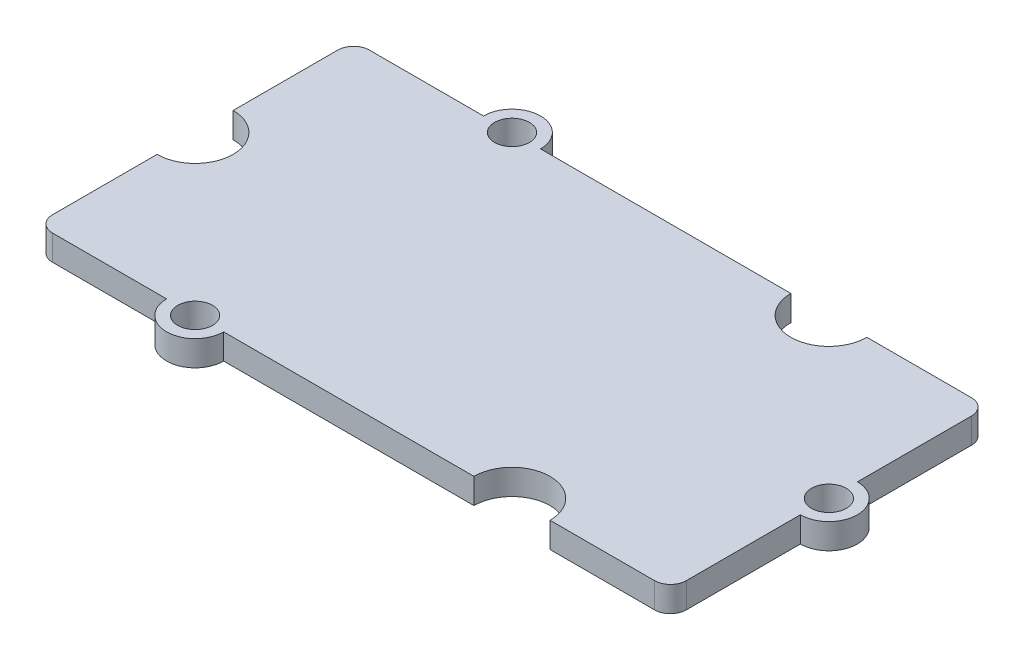
ISO-10303-21;
HEADER;
FILE_DESCRIPTION(('STEP AP214'),'2;1');
FILE_NAME('part.step','',(''),(''),'','','');
FILE_SCHEMA(('AUTOMOTIVE_DESIGN { 1 0 10303 214 1 1 1 1 }'));
ENDSEC;
DATA;
#1=APPLICATION_CONTEXT('core data for automotive mechanical design processes');
#2=APPLICATION_PROTOCOL_DEFINITION('international standard','automotive_design',2000,#1);
#3=PRODUCT_CONTEXT('',#1,'mechanical');
#4=PRODUCT('Part','Part','',(#3));
#5=PRODUCT_RELATED_PRODUCT_CATEGORY('part','',(#4));
#6=PRODUCT_DEFINITION_FORMATION('','',#4);
#7=PRODUCT_DEFINITION_CONTEXT('part definition',#1,'design');
#8=PRODUCT_DEFINITION('design','',#6,#7);
#9=PRODUCT_DEFINITION_SHAPE('','',#8);
#10=(LENGTH_UNIT() NAMED_UNIT(*) SI_UNIT(.MILLI.,.METRE.));
#11=(NAMED_UNIT(*) PLANE_ANGLE_UNIT() SI_UNIT($,.RADIAN.));
#12=(NAMED_UNIT(*) SI_UNIT($,.STERADIAN.) SOLID_ANGLE_UNIT());
#13=UNCERTAINTY_MEASURE_WITH_UNIT(LENGTH_MEASURE(1.E-05),#10,'distance_accuracy_value','');
#14=(GEOMETRIC_REPRESENTATION_CONTEXT(3) GLOBAL_UNCERTAINTY_ASSIGNED_CONTEXT((#13)) GLOBAL_UNIT_ASSIGNED_CONTEXT((#10,
#11,#12)) REPRESENTATION_CONTEXT('',''));
#15=CARTESIAN_POINT('',(0.,0.,0.));
#16=DIRECTION('',(0.,0.,1.));
#17=DIRECTION('',(1.,0.,0.));
#18=AXIS2_PLACEMENT_3D('',#15,#16,#17);
#19=CARTESIAN_POINT('',(20.,1.6,0.));
#20=DIRECTION('',(0.,-1.,0.));
#21=DIRECTION('',(0.,0.,-1.));
#22=AXIS2_PLACEMENT_3D('',#19,#20,#21);
#23=CYLINDRICAL_SURFACE('',#22,1.8);
#24=CARTESIAN_POINT('',(20.,0.,0.));
#25=DIRECTION('',(0.,1.,0.));
#26=DIRECTION('',(0.,0.,1.));
#27=AXIS2_PLACEMENT_3D('',#24,#25,#26);
#28=CIRCLE('',#27,1.8);
#29=CARTESIAN_POINT('',(20.,0.,1.8));
#30=VERTEX_POINT('',#29);
#31=CARTESIAN_POINT('',(20.,0.,-1.8));
#32=VERTEX_POINT('',#31);
#33=EDGE_CURVE('E214',#30,#32,#28,.T.);
#34=ORIENTED_EDGE('',*,*,#33,.T.);
#35=DIRECTION('',(0.,-1.,0.));
#36=VECTOR('',#35,1.);
#37=CARTESIAN_POINT('',(20.,1.6,-1.8));
#38=LINE('',#37,#36);
#39=CARTESIAN_POINT('',(20.,1.6,-1.8));
#40=VERTEX_POINT('',#39);
#41=EDGE_CURVE('E11',#40,#32,#38,.T.);
#42=ORIENTED_EDGE('',*,*,#41,.F.);
#43=CARTESIAN_POINT('',(20.,1.6,0.));
#44=DIRECTION('',(0.,1.,0.));
#45=DIRECTION('',(0.,0.,1.));
#46=AXIS2_PLACEMENT_3D('',#43,#44,#45);
#47=CIRCLE('',#46,1.8);
#48=CARTESIAN_POINT('',(20.,1.6,1.8));
#49=VERTEX_POINT('',#48);
#50=EDGE_CURVE('E265',#49,#40,#47,.T.);
#51=ORIENTED_EDGE('',*,*,#50,.F.);
#52=DIRECTION('',(0.,-1.,0.));
#53=VECTOR('',#52,1.);
#54=CARTESIAN_POINT('',(20.,1.6,1.8));
#55=LINE('',#54,#53);
#56=EDGE_CURVE('E213',#49,#30,#55,.T.);
#57=ORIENTED_EDGE('',*,*,#56,.T.);
#58=EDGE_LOOP('',(#34,#42,#51,#57));
#59=FACE_BOUND('',#58,.T.);
#60=ADVANCED_FACE('F34',(#59),#23,.T.);
#61=CARTESIAN_POINT('',(20.,1.6,0.));
#62=DIRECTION('',(-1.,0.,0.));
#63=DIRECTION('',(0.,0.,1.));
#64=AXIS2_PLACEMENT_3D('',#61,#62,#63);
#65=PLANE('',#64);
#66=DIRECTION('',(0.,0.,-1.));
#67=VECTOR('',#66,1.);
#68=CARTESIAN_POINT('',(20.,0.,0.));
#69=LINE('',#68,#67);
#70=CARTESIAN_POINT('',(20.,0.,-9.));
#71=VERTEX_POINT('',#70);
#72=EDGE_CURVE('E217',#32,#71,#69,.T.);
#73=ORIENTED_EDGE('',*,*,#72,.T.);
#74=DIRECTION('',(0.,-1.,0.));
#75=VECTOR('',#74,1.);
#76=CARTESIAN_POINT('',(20.,1.6,-9.));
#77=LINE('',#76,#75);
#78=CARTESIAN_POINT('',(20.,1.6,-9.));
#79=VERTEX_POINT('',#78);
#80=EDGE_CURVE('E42',#79,#71,#77,.T.);
#81=ORIENTED_EDGE('',*,*,#80,.F.);
#82=DIRECTION('',(0.,0.,-1.));
#83=VECTOR('',#82,1.);
#84=CARTESIAN_POINT('',(20.,1.6,0.));
#85=LINE('',#84,#83);
#86=EDGE_CURVE('E129',#40,#79,#85,.T.);
#87=ORIENTED_EDGE('',*,*,#86,.F.);
#88=ORIENTED_EDGE('',*,*,#41,.T.);
#89=EDGE_LOOP('',(#73,#81,#87,#88));
#90=FACE_BOUND('',#89,.T.);
#91=ADVANCED_FACE('F304',(#90),#65,.F.);
#92=CARTESIAN_POINT('',(19.,1.6,-9.));
#93=DIRECTION('',(0.,-1.,0.));
#94=DIRECTION('',(0.,0.,-1.));
#95=AXIS2_PLACEMENT_3D('',#92,#93,#94);
#96=CYLINDRICAL_SURFACE('',#95,1.);
#97=CARTESIAN_POINT('',(19.,0.,-9.));
#98=DIRECTION('',(0.,1.,0.));
#99=DIRECTION('',(0.,0.,1.));
#100=AXIS2_PLACEMENT_3D('',#97,#98,#99);
#101=CIRCLE('',#100,1.);
#102=CARTESIAN_POINT('',(19.,0.,-10.));
#103=VERTEX_POINT('',#102);
#104=EDGE_CURVE('E220',#103,#71,#101,.F.);
#105=ORIENTED_EDGE('',*,*,#104,.F.);
#106=DIRECTION('',(0.,-1.,0.));
#107=VECTOR('',#106,1.);
#108=CARTESIAN_POINT('',(19.,1.6,-10.));
#109=LINE('',#108,#107);
#110=CARTESIAN_POINT('',(19.,1.6,-10.));
#111=VERTEX_POINT('',#110);
#112=EDGE_CURVE('E297',#111,#103,#109,.T.);
#113=ORIENTED_EDGE('',*,*,#112,.F.);
#114=CARTESIAN_POINT('',(19.,1.6,-9.));
#115=DIRECTION('',(0.,1.,0.));
#116=DIRECTION('',(0.,0.,1.));
#117=AXIS2_PLACEMENT_3D('',#114,#115,#116);
#118=CIRCLE('',#117,1.);
#119=EDGE_CURVE('E303',#111,#79,#118,.F.);
#120=ORIENTED_EDGE('',*,*,#119,.T.);
#121=ORIENTED_EDGE('',*,*,#80,.T.);
#122=EDGE_LOOP('',(#105,#113,#120,#121));
#123=FACE_BOUND('',#122,.T.);
#124=ADVANCED_FACE('F301',(#123),#96,.T.);
#125=CARTESIAN_POINT('',(0.,1.6,-9.99999999999999));
#126=DIRECTION('',(0.,0.,-1.));
#127=DIRECTION('',(-1.,0.,0.));
#128=AXIS2_PLACEMENT_3D('',#125,#126,#127);
#129=PLANE('',#128);
#130=DIRECTION('',(1.,0.,0.));
#131=VECTOR('',#130,1.);
#132=CARTESIAN_POINT('',(0.,0.,-9.99999999999999));
#133=LINE('',#132,#131);
#134=CARTESIAN_POINT('',(12.4,0.,-10.));
#135=VERTEX_POINT('',#134);
#136=EDGE_CURVE('E223',#135,#103,#133,.T.);
#137=ORIENTED_EDGE('',*,*,#136,.F.);
#138=DIRECTION('',(0.,-1.,0.));
#139=VECTOR('',#138,1.);
#140=CARTESIAN_POINT('',(12.4,1.6,-10.));
#141=LINE('',#140,#139);
#142=CARTESIAN_POINT('',(12.4,1.6,-10.));
#143=VERTEX_POINT('',#142);
#144=EDGE_CURVE('E295',#143,#135,#141,.T.);
#145=ORIENTED_EDGE('',*,*,#144,.F.);
#146=DIRECTION('',(1.,0.,0.));
#147=VECTOR('',#146,1.);
#148=CARTESIAN_POINT('',(0.,1.6,-9.99999999999999));
#149=LINE('',#148,#147);
#150=EDGE_CURVE('E317',#143,#111,#149,.T.);
#151=ORIENTED_EDGE('',*,*,#150,.T.);
#152=ORIENTED_EDGE('',*,*,#112,.T.);
#153=EDGE_LOOP('',(#137,#145,#151,#152));
#154=FACE_BOUND('',#153,.T.);
#155=ADVANCED_FACE('F314',(#154),#129,.T.);
#156=CARTESIAN_POINT('',(10.,1.6,-9.99999999999999));
#157=DIRECTION('',(0.,-1.,0.));
#158=DIRECTION('',(0.,0.,-1.));
#159=AXIS2_PLACEMENT_3D('',#156,#157,#158);
#160=CYLINDRICAL_SURFACE('',#159,2.4);
#161=CARTESIAN_POINT('',(10.,0.,-9.99999999999999));
#162=DIRECTION('',(0.,1.,0.));
#163=DIRECTION('',(0.,0.,1.));
#164=AXIS2_PLACEMENT_3D('',#161,#162,#163);
#165=CIRCLE('',#164,2.4);
#166=CARTESIAN_POINT('',(7.6,0.,-10.));
#167=VERTEX_POINT('',#166);
#168=EDGE_CURVE('E226',#167,#135,#165,.T.);
#169=ORIENTED_EDGE('',*,*,#168,.F.);
#170=DIRECTION('',(0.,-1.,0.));
#171=VECTOR('',#170,1.);
#172=CARTESIAN_POINT('',(7.6,1.6,-10.));
#173=LINE('',#172,#171);
#174=CARTESIAN_POINT('',(7.6,1.6,-10.));
#175=VERTEX_POINT('',#174);
#176=EDGE_CURVE('E293',#175,#167,#173,.T.);
#177=ORIENTED_EDGE('',*,*,#176,.F.);
#178=CARTESIAN_POINT('',(10.,1.6,-9.99999999999999));
#179=DIRECTION('',(0.,1.,0.));
#180=DIRECTION('',(0.,0.,1.));
#181=AXIS2_PLACEMENT_3D('',#178,#179,#180);
#182=CIRCLE('',#181,2.4);
#183=EDGE_CURVE('E321',#175,#143,#182,.T.);
#184=ORIENTED_EDGE('',*,*,#183,.T.);
#185=ORIENTED_EDGE('',*,*,#144,.T.);
#186=EDGE_LOOP('',(#169,#177,#184,#185));
#187=FACE_BOUND('',#186,.T.);
#188=ADVANCED_FACE('F399',(#187),#160,.F.);
#189=CARTESIAN_POINT('',(-8.2,0.,-9.99999999999999));
#190=VERTEX_POINT('',#189);
#191=EDGE_CURVE('E228',#190,#167,#133,.T.);
#192=ORIENTED_EDGE('',*,*,#191,.F.);
#193=DIRECTION('',(0.,-1.,0.));
#194=VECTOR('',#193,1.);
#195=CARTESIAN_POINT('',(-8.2,1.6,-9.99999999999999));
#196=LINE('',#195,#194);
#197=CARTESIAN_POINT('',(-8.2,1.6,-9.99999999999999));
#198=VERTEX_POINT('',#197);
#199=EDGE_CURVE('E291',#198,#190,#196,.T.);
#200=ORIENTED_EDGE('',*,*,#199,.F.);
#201=EDGE_CURVE('E324',#198,#175,#149,.T.);
#202=ORIENTED_EDGE('',*,*,#201,.T.);
#203=ORIENTED_EDGE('',*,*,#176,.T.);
#204=EDGE_LOOP('',(#192,#200,#202,#203));
#205=FACE_BOUND('',#204,.T.);
#206=ADVANCED_FACE('F394',(#205),#129,.T.);
#207=CARTESIAN_POINT('',(-10.,1.6,-9.99999999999999));
#208=DIRECTION('',(0.,-1.,0.));
#209=DIRECTION('',(0.,0.,-1.));
#210=AXIS2_PLACEMENT_3D('',#207,#208,#209);
#211=CYLINDRICAL_SURFACE('',#210,1.8);
#212=CARTESIAN_POINT('',(-10.,0.,-9.99999999999999));
#213=DIRECTION('',(0.,1.,0.));
#214=DIRECTION('',(0.,0.,1.));
#215=AXIS2_PLACEMENT_3D('',#212,#213,#214);
#216=CIRCLE('',#215,1.8);
#217=CARTESIAN_POINT('',(-11.8,0.,-9.99999999999999));
#218=VERTEX_POINT('',#217);
#219=EDGE_CURVE('E231',#190,#218,#216,.T.);
#220=ORIENTED_EDGE('',*,*,#219,.T.);
#221=DIRECTION('',(0.,-1.,0.));
#222=VECTOR('',#221,1.);
#223=CARTESIAN_POINT('',(-11.8,1.6,-9.99999999999999));
#224=LINE('',#223,#222);
#225=CARTESIAN_POINT('',(-11.8,1.6,-9.99999999999999));
#226=VERTEX_POINT('',#225);
#227=EDGE_CURVE('E289',#226,#218,#224,.T.);
#228=ORIENTED_EDGE('',*,*,#227,.F.);
#229=CARTESIAN_POINT('',(-10.,1.6,-9.99999999999999));
#230=DIRECTION('',(0.,1.,0.));
#231=DIRECTION('',(0.,0.,1.));
#232=AXIS2_PLACEMENT_3D('',#229,#230,#231);
#233=CIRCLE('',#232,1.8);
#234=EDGE_CURVE('E328',#198,#226,#233,.T.);
#235=ORIENTED_EDGE('',*,*,#234,.F.);
#236=ORIENTED_EDGE('',*,*,#199,.T.);
#237=EDGE_LOOP('',(#220,#228,#235,#236));
#238=FACE_BOUND('',#237,.T.);
#239=ADVANCED_FACE('F401',(#238),#211,.T.);
#240=CARTESIAN_POINT('',(-19.,0.,-9.99999999999999));
#241=VERTEX_POINT('',#240);
#242=EDGE_CURVE('E227',#241,#218,#133,.T.);
#243=ORIENTED_EDGE('',*,*,#242,.F.);
#244=DIRECTION('',(0.,-1.,0.));
#245=VECTOR('',#244,1.);
#246=CARTESIAN_POINT('',(-19.,1.6,-9.99999999999999));
#247=LINE('',#246,#245);
#248=CARTESIAN_POINT('',(-19.,1.6,-9.99999999999999));
#249=VERTEX_POINT('',#248);
#250=EDGE_CURVE('E287',#249,#241,#247,.T.);
#251=ORIENTED_EDGE('',*,*,#250,.F.);
#252=EDGE_CURVE('E323',#249,#226,#149,.T.);
#253=ORIENTED_EDGE('',*,*,#252,.T.);
#254=ORIENTED_EDGE('',*,*,#227,.T.);
#255=EDGE_LOOP('',(#243,#251,#253,#254));
#256=FACE_BOUND('',#255,.T.);
#257=ADVANCED_FACE('F390',(#256),#129,.T.);
#258=CARTESIAN_POINT('',(-19.,1.6,-8.99999999999999));
#259=DIRECTION('',(0.,-1.,0.));
#260=DIRECTION('',(0.,0.,-1.));
#261=AXIS2_PLACEMENT_3D('',#258,#259,#260);
#262=CYLINDRICAL_SURFACE('',#261,1.);
#263=CARTESIAN_POINT('',(-19.,0.,-8.99999999999999));
#264=DIRECTION('',(0.,1.,0.));
#265=DIRECTION('',(0.,0.,1.));
#266=AXIS2_PLACEMENT_3D('',#263,#264,#265);
#267=CIRCLE('',#266,1.);
#268=CARTESIAN_POINT('',(-20.,0.,-8.99999999999999));
#269=VERTEX_POINT('',#268);
#270=EDGE_CURVE('E234',#269,#241,#267,.F.);
#271=ORIENTED_EDGE('',*,*,#270,.F.);
#272=DIRECTION('',(0.,-1.,0.));
#273=VECTOR('',#272,1.);
#274=CARTESIAN_POINT('',(-20.,1.6,-8.99999999999999));
#275=LINE('',#274,#273);
#276=CARTESIAN_POINT('',(-20.,1.6,-8.99999999999999));
#277=VERTEX_POINT('',#276);
#278=EDGE_CURVE('E285',#277,#269,#275,.T.);
#279=ORIENTED_EDGE('',*,*,#278,.F.);
#280=CARTESIAN_POINT('',(-19.,1.6,-8.99999999999999));
#281=DIRECTION('',(0.,1.,0.));
#282=DIRECTION('',(0.,0.,1.));
#283=AXIS2_PLACEMENT_3D('',#280,#281,#282);
#284=CIRCLE('',#283,1.);
#285=EDGE_CURVE('E330',#277,#249,#284,.F.);
#286=ORIENTED_EDGE('',*,*,#285,.T.);
#287=ORIENTED_EDGE('',*,*,#250,.T.);
#288=EDGE_LOOP('',(#271,#279,#286,#287));
#289=FACE_BOUND('',#288,.T.);
#290=ADVANCED_FACE('F385',(#289),#262,.T.);
#291=CARTESIAN_POINT('',(-20.,1.6,0.));
#292=DIRECTION('',(-1.,0.,0.));
#293=DIRECTION('',(0.,0.,1.));
#294=AXIS2_PLACEMENT_3D('',#291,#292,#293);
#295=PLANE('',#294);
#296=DIRECTION('',(0.,0.,-1.));
#297=VECTOR('',#296,1.);
#298=CARTESIAN_POINT('',(-20.,0.,0.));
#299=LINE('',#298,#297);
#300=CARTESIAN_POINT('',(-20.,0.,-2.39999999999999));
#301=VERTEX_POINT('',#300);
#302=EDGE_CURVE('E237',#301,#269,#299,.T.);
#303=ORIENTED_EDGE('',*,*,#302,.F.);
#304=DIRECTION('',(0.,-1.,0.));
#305=VECTOR('',#304,1.);
#306=CARTESIAN_POINT('',(-20.,1.6,-2.39999999999999));
#307=LINE('',#306,#305);
#308=CARTESIAN_POINT('',(-20.,1.6,-2.39999999999999));
#309=VERTEX_POINT('',#308);
#310=EDGE_CURVE('E283',#309,#301,#307,.T.);
#311=ORIENTED_EDGE('',*,*,#310,.F.);
#312=DIRECTION('',(0.,0.,-1.));
#313=VECTOR('',#312,1.);
#314=CARTESIAN_POINT('',(-20.,1.6,0.));
#315=LINE('',#314,#313);
#316=EDGE_CURVE('E333',#309,#277,#315,.T.);
#317=ORIENTED_EDGE('',*,*,#316,.T.);
#318=ORIENTED_EDGE('',*,*,#278,.T.);
#319=EDGE_LOOP('',(#303,#311,#317,#318));
#320=FACE_BOUND('',#319,.T.);
#321=ADVANCED_FACE('F379',(#320),#295,.T.);
#322=CARTESIAN_POINT('',(-20.,1.6,0.));
#323=DIRECTION('',(0.,-1.,0.));
#324=DIRECTION('',(0.,0.,-1.));
#325=AXIS2_PLACEMENT_3D('',#322,#323,#324);
#326=CYLINDRICAL_SURFACE('',#325,2.4);
#327=CARTESIAN_POINT('',(-20.,0.,0.));
#328=DIRECTION('',(0.,1.,0.));
#329=DIRECTION('',(0.,0.,1.));
#330=AXIS2_PLACEMENT_3D('',#327,#328,#329);
#331=CIRCLE('',#330,2.4);
#332=CARTESIAN_POINT('',(-20.,0.,2.40000000000001));
#333=VERTEX_POINT('',#332);
#334=EDGE_CURVE('E240',#333,#301,#331,.T.);
#335=ORIENTED_EDGE('',*,*,#334,.F.);
#336=DIRECTION('',(0.,-1.,0.));
#337=VECTOR('',#336,1.);
#338=CARTESIAN_POINT('',(-20.,1.6,2.40000000000001));
#339=LINE('',#338,#337);
#340=CARTESIAN_POINT('',(-20.,1.6,2.40000000000001));
#341=VERTEX_POINT('',#340);
#342=EDGE_CURVE('E281',#341,#333,#339,.T.);
#343=ORIENTED_EDGE('',*,*,#342,.F.);
#344=CARTESIAN_POINT('',(-20.,1.6,0.));
#345=DIRECTION('',(0.,1.,0.));
#346=DIRECTION('',(0.,0.,1.));
#347=AXIS2_PLACEMENT_3D('',#344,#345,#346);
#348=CIRCLE('',#347,2.4);
#349=EDGE_CURVE('E336',#341,#309,#348,.T.);
#350=ORIENTED_EDGE('',*,*,#349,.T.);
#351=ORIENTED_EDGE('',*,*,#310,.T.);
#352=EDGE_LOOP('',(#335,#343,#350,#351));
#353=FACE_BOUND('',#352,.T.);
#354=ADVANCED_FACE('F375',(#353),#326,.F.);
#355=CARTESIAN_POINT('',(-20.,0.,9.00000000000001));
#356=VERTEX_POINT('',#355);
#357=EDGE_CURVE('E241',#356,#333,#299,.T.);
#358=ORIENTED_EDGE('',*,*,#357,.F.);
#359=DIRECTION('',(0.,-1.,0.));
#360=VECTOR('',#359,1.);
#361=CARTESIAN_POINT('',(-20.,1.6,9.00000000000001));
#362=LINE('',#361,#360);
#363=CARTESIAN_POINT('',(-20.,1.6,9.00000000000001));
#364=VERTEX_POINT('',#363);
#365=EDGE_CURVE('E279',#364,#356,#362,.T.);
#366=ORIENTED_EDGE('',*,*,#365,.F.);
#367=EDGE_CURVE('E337',#364,#341,#315,.T.);
#368=ORIENTED_EDGE('',*,*,#367,.T.);
#369=ORIENTED_EDGE('',*,*,#342,.T.);
#370=EDGE_LOOP('',(#358,#366,#368,#369));
#371=FACE_BOUND('',#370,.T.);
#372=ADVANCED_FACE('F370',(#371),#295,.T.);
#373=CARTESIAN_POINT('',(-19.,1.6,9.00000000000001));
#374=DIRECTION('',(0.,-1.,0.));
#375=DIRECTION('',(0.,0.,-1.));
#376=AXIS2_PLACEMENT_3D('',#373,#374,#375);
#377=CYLINDRICAL_SURFACE('',#376,1.);
#378=CARTESIAN_POINT('',(-19.,0.,9.00000000000001));
#379=DIRECTION('',(0.,1.,0.));
#380=DIRECTION('',(0.,0.,1.));
#381=AXIS2_PLACEMENT_3D('',#378,#379,#380);
#382=CIRCLE('',#381,1.);
#383=CARTESIAN_POINT('',(-19.,0.,10.));
#384=VERTEX_POINT('',#383);
#385=EDGE_CURVE('E244',#384,#356,#382,.F.);
#386=ORIENTED_EDGE('',*,*,#385,.F.);
#387=DIRECTION('',(0.,-1.,0.));
#388=VECTOR('',#387,1.);
#389=CARTESIAN_POINT('',(-19.,1.6,10.));
#390=LINE('',#389,#388);
#391=CARTESIAN_POINT('',(-19.,1.6,10.));
#392=VERTEX_POINT('',#391);
#393=EDGE_CURVE('E277',#392,#384,#390,.T.);
#394=ORIENTED_EDGE('',*,*,#393,.F.);
#395=CARTESIAN_POINT('',(-19.,1.6,9.00000000000001));
#396=DIRECTION('',(0.,1.,0.));
#397=DIRECTION('',(0.,0.,1.));
#398=AXIS2_PLACEMENT_3D('',#395,#396,#397);
#399=CIRCLE('',#398,1.);
#400=EDGE_CURVE('E340',#392,#364,#399,.F.);
#401=ORIENTED_EDGE('',*,*,#400,.T.);
#402=ORIENTED_EDGE('',*,*,#365,.T.);
#403=EDGE_LOOP('',(#386,#394,#401,#402));
#404=FACE_BOUND('',#403,.T.);
#405=ADVANCED_FACE('F365',(#404),#377,.T.);
#406=CARTESIAN_POINT('',(0.,1.6,10.));
#407=DIRECTION('',(0.,0.,-1.));
#408=DIRECTION('',(-1.,0.,0.));
#409=AXIS2_PLACEMENT_3D('',#406,#407,#408);
#410=PLANE('',#409);
#411=DIRECTION('',(1.,0.,0.));
#412=VECTOR('',#411,1.);
#413=CARTESIAN_POINT('',(0.,0.,10.));
#414=LINE('',#413,#412);
#415=CARTESIAN_POINT('',(-11.8,0.,10.));
#416=VERTEX_POINT('',#415);
#417=EDGE_CURVE('E247',#384,#416,#414,.T.);
#418=ORIENTED_EDGE('',*,*,#417,.T.);
#419=DIRECTION('',(0.,-1.,0.));
#420=VECTOR('',#419,1.);
#421=CARTESIAN_POINT('',(-11.8,1.6,10.));
#422=LINE('',#421,#420);
#423=CARTESIAN_POINT('',(-11.8,1.6,10.));
#424=VERTEX_POINT('',#423);
#425=EDGE_CURVE('E274',#424,#416,#422,.T.);
#426=ORIENTED_EDGE('',*,*,#425,.F.);
#427=DIRECTION('',(1.,0.,0.));
#428=VECTOR('',#427,1.);
#429=CARTESIAN_POINT('',(0.,1.6,10.));
#430=LINE('',#429,#428);
#431=EDGE_CURVE('E190',#392,#424,#430,.T.);
#432=ORIENTED_EDGE('',*,*,#431,.F.);
#433=ORIENTED_EDGE('',*,*,#393,.T.);
#434=EDGE_LOOP('',(#418,#426,#432,#433));
#435=FACE_BOUND('',#434,.T.);
#436=ADVANCED_FACE('F362',(#435),#410,.F.);
#437=CARTESIAN_POINT('',(-10.,1.6,10.));
#438=DIRECTION('',(0.,-1.,0.));
#439=DIRECTION('',(0.,0.,-1.));
#440=AXIS2_PLACEMENT_3D('',#437,#438,#439);
#441=CYLINDRICAL_SURFACE('',#440,1.8);
#442=CARTESIAN_POINT('',(-10.,0.,10.));
#443=DIRECTION('',(0.,1.,0.));
#444=DIRECTION('',(0.,0.,1.));
#445=AXIS2_PLACEMENT_3D('',#442,#443,#444);
#446=CIRCLE('',#445,1.8);
#447=CARTESIAN_POINT('',(-8.2,0.,10.));
#448=VERTEX_POINT('',#447);
#449=EDGE_CURVE('E249',#416,#448,#446,.T.);
#450=ORIENTED_EDGE('',*,*,#449,.T.);
#451=DIRECTION('',(0.,-1.,0.));
#452=VECTOR('',#451,1.);
#453=CARTESIAN_POINT('',(-8.2,1.6,10.));
#454=LINE('',#453,#452);
#455=CARTESIAN_POINT('',(-8.2,1.6,10.));
#456=VERTEX_POINT('',#455);
#457=EDGE_CURVE('E271',#456,#448,#454,.T.);
#458=ORIENTED_EDGE('',*,*,#457,.F.);
#459=CARTESIAN_POINT('',(-10.,1.6,10.));
#460=DIRECTION('',(0.,1.,0.));
#461=DIRECTION('',(0.,0.,1.));
#462=AXIS2_PLACEMENT_3D('',#459,#460,#461);
#463=CIRCLE('',#462,1.8);
#464=EDGE_CURVE('E342',#424,#456,#463,.T.);
#465=ORIENTED_EDGE('',*,*,#464,.F.);
#466=ORIENTED_EDGE('',*,*,#425,.T.);
#467=EDGE_LOOP('',(#450,#458,#465,#466));
#468=FACE_BOUND('',#467,.T.);
#469=ADVANCED_FACE('F358',(#468),#441,.T.);
#470=CARTESIAN_POINT('',(7.6,0.,10.));
#471=VERTEX_POINT('',#470);
#472=EDGE_CURVE('E250',#448,#471,#414,.T.);
#473=ORIENTED_EDGE('',*,*,#472,.T.);
#474=DIRECTION('',(0.,-1.,0.));
#475=VECTOR('',#474,1.);
#476=CARTESIAN_POINT('',(7.6,1.6,10.));
#477=LINE('',#476,#475);
#478=CARTESIAN_POINT('',(7.6,1.6,10.));
#479=VERTEX_POINT('',#478);
#480=EDGE_CURVE('E269',#479,#471,#477,.T.);
#481=ORIENTED_EDGE('',*,*,#480,.F.);
#482=EDGE_CURVE('E189',#456,#479,#430,.T.);
#483=ORIENTED_EDGE('',*,*,#482,.F.);
#484=ORIENTED_EDGE('',*,*,#457,.T.);
#485=EDGE_LOOP('',(#473,#481,#483,#484));
#486=FACE_BOUND('',#485,.T.);
#487=ADVANCED_FACE('F353',(#486),#410,.F.);
#488=CARTESIAN_POINT('',(10.,1.6,10.));
#489=DIRECTION('',(0.,-1.,0.));
#490=DIRECTION('',(0.,0.,-1.));
#491=AXIS2_PLACEMENT_3D('',#488,#489,#490);
#492=CYLINDRICAL_SURFACE('',#491,2.4);
#493=CARTESIAN_POINT('',(10.,0.,10.));
#494=DIRECTION('',(0.,1.,0.));
#495=DIRECTION('',(0.,0.,1.));
#496=AXIS2_PLACEMENT_3D('',#493,#494,#495);
#497=CIRCLE('',#496,2.4);
#498=CARTESIAN_POINT('',(12.4,0.,10.));
#499=VERTEX_POINT('',#498);
#500=EDGE_CURVE('E252',#499,#471,#497,.T.);
#501=ORIENTED_EDGE('',*,*,#500,.F.);
#502=DIRECTION('',(0.,-1.,0.));
#503=VECTOR('',#502,1.);
#504=CARTESIAN_POINT('',(12.4,1.6,10.));
#505=LINE('',#504,#503);
#506=CARTESIAN_POINT('',(12.4,1.6,10.));
#507=VERTEX_POINT('',#506);
#508=EDGE_CURVE('E195',#507,#499,#505,.T.);
#509=ORIENTED_EDGE('',*,*,#508,.F.);
#510=CARTESIAN_POINT('',(10.,1.6,10.));
#511=DIRECTION('',(0.,1.,0.));
#512=DIRECTION('',(0.,0.,1.));
#513=AXIS2_PLACEMENT_3D('',#510,#511,#512);
#514=CIRCLE('',#513,2.4);
#515=EDGE_CURVE('E186',#507,#479,#514,.T.);
#516=ORIENTED_EDGE('',*,*,#515,.T.);
#517=ORIENTED_EDGE('',*,*,#480,.T.);
#518=EDGE_LOOP('',(#501,#509,#516,#517));
#519=FACE_BOUND('',#518,.T.);
#520=ADVANCED_FACE('F349',(#519),#492,.F.);
#521=CARTESIAN_POINT('',(19.,0.,10.));
#522=VERTEX_POINT('',#521);
#523=EDGE_CURVE('E194',#499,#522,#414,.T.);
#524=ORIENTED_EDGE('',*,*,#523,.T.);
#525=DIRECTION('',(0.,-1.,0.));
#526=VECTOR('',#525,1.);
#527=CARTESIAN_POINT('',(19.,1.6,10.));
#528=LINE('',#527,#526);
#529=CARTESIAN_POINT('',(19.,1.6,10.));
#530=VERTEX_POINT('',#529);
#531=EDGE_CURVE('E191',#530,#522,#528,.T.);
#532=ORIENTED_EDGE('',*,*,#531,.F.);
#533=EDGE_CURVE('E179',#507,#530,#430,.T.);
#534=ORIENTED_EDGE('',*,*,#533,.F.);
#535=ORIENTED_EDGE('',*,*,#508,.T.);
#536=EDGE_LOOP('',(#524,#532,#534,#535));
#537=FACE_BOUND('',#536,.T.);
#538=ADVANCED_FACE('F192',(#537),#410,.F.);
#539=CARTESIAN_POINT('',(19.,1.6,9.00000000000001));
#540=DIRECTION('',(0.,-1.,0.));
#541=DIRECTION('',(0.,0.,-1.));
#542=AXIS2_PLACEMENT_3D('',#539,#540,#541);
#543=CYLINDRICAL_SURFACE('',#542,1.);
#544=CARTESIAN_POINT('',(19.,0.,9.00000000000001));
#545=DIRECTION('',(0.,1.,0.));
#546=DIRECTION('',(0.,0.,1.));
#547=AXIS2_PLACEMENT_3D('',#544,#545,#546);
#548=CIRCLE('',#547,1.);
#549=CARTESIAN_POINT('',(20.,0.,9.00000000000001));
#550=VERTEX_POINT('',#549);
#551=EDGE_CURVE('E115',#522,#550,#548,.T.);
#552=ORIENTED_EDGE('',*,*,#551,.T.);
#553=DIRECTION('',(0.,-1.,0.));
#554=VECTOR('',#553,1.);
#555=CARTESIAN_POINT('',(20.,1.6,9.00000000000001));
#556=LINE('',#555,#554);
#557=CARTESIAN_POINT('',(20.,1.6,9.00000000000001));
#558=VERTEX_POINT('',#557);
#559=EDGE_CURVE('E196',#558,#550,#556,.T.);
#560=ORIENTED_EDGE('',*,*,#559,.F.);
#561=CARTESIAN_POINT('',(19.,1.6,9.00000000000001));
#562=DIRECTION('',(0.,1.,0.));
#563=DIRECTION('',(0.,0.,1.));
#564=AXIS2_PLACEMENT_3D('',#561,#562,#563);
#565=CIRCLE('',#564,1.);
#566=EDGE_CURVE('E184',#530,#558,#565,.T.);
#567=ORIENTED_EDGE('',*,*,#566,.F.);
#568=ORIENTED_EDGE('',*,*,#531,.T.);
#569=EDGE_LOOP('',(#552,#560,#567,#568));
#570=FACE_BOUND('',#569,.T.);
#571=ADVANCED_FACE('F198',(#570),#543,.T.);
#572=CARTESIAN_POINT('',(20.,1.6,0.));
#573=DIRECTION('',(0.,-1.,0.));
#574=DIRECTION('',(0.,0.,-1.));
#575=AXIS2_PLACEMENT_3D('',#572,#573,#574);
#576=CYLINDRICAL_SURFACE('',#575,1.1);
#577=CARTESIAN_POINT('',(20.,1.6,0.));
#578=DIRECTION('',(0.,1.,0.));
#579=DIRECTION('',(0.,0.,1.));
#580=AXIS2_PLACEMENT_3D('',#577,#578,#579);
#581=CIRCLE('',#580,1.1);
#582=CARTESIAN_POINT('',(20.,1.6,1.1));
#583=VERTEX_POINT('',#582);
#584=EDGE_CURVE('E207',#583,#583,#581,.T.);
#585=ORIENTED_EDGE('',*,*,#584,.T.);
#586=EDGE_LOOP('',(#585));
#587=FACE_BOUND('',#586,.T.);
#588=CARTESIAN_POINT('',(20.,0.,0.));
#589=DIRECTION('',(0.,1.,0.));
#590=DIRECTION('',(0.,0.,1.));
#591=AXIS2_PLACEMENT_3D('',#588,#589,#590);
#592=CIRCLE('',#591,1.1);
#593=CARTESIAN_POINT('',(20.,0.,1.1));
#594=VERTEX_POINT('',#593);
#595=EDGE_CURVE('E259',#594,#594,#592,.T.);
#596=ORIENTED_EDGE('',*,*,#595,.F.);
#597=EDGE_LOOP('',(#596));
#598=FACE_BOUND('',#597,.T.);
#599=ADVANCED_FACE('F427',(#587,#598),#576,.F.);
#600=CARTESIAN_POINT('',(-10.,1.6,-9.99999999999999));
#601=DIRECTION('',(0.,-1.,0.));
#602=DIRECTION('',(0.,0.,-1.));
#603=AXIS2_PLACEMENT_3D('',#600,#601,#602);
#604=CYLINDRICAL_SURFACE('',#603,1.1);
#605=CARTESIAN_POINT('',(-10.,1.6,-9.99999999999999));
#606=DIRECTION('',(0.,1.,0.));
#607=DIRECTION('',(0.,0.,1.));
#608=AXIS2_PLACEMENT_3D('',#605,#606,#607);
#609=CIRCLE('',#608,1.1);
#610=CARTESIAN_POINT('',(-10.,1.6,-8.89999999999999));
#611=VERTEX_POINT('',#610);
#612=EDGE_CURVE('E200',#611,#611,#609,.T.);
#613=ORIENTED_EDGE('',*,*,#612,.T.);
#614=EDGE_LOOP('',(#613));
#615=FACE_BOUND('',#614,.T.);
#616=CARTESIAN_POINT('',(-10.,0.,-9.99999999999999));
#617=DIRECTION('',(0.,1.,0.));
#618=DIRECTION('',(0.,0.,1.));
#619=AXIS2_PLACEMENT_3D('',#616,#617,#618);
#620=CIRCLE('',#619,1.1);
#621=CARTESIAN_POINT('',(-10.,0.,-8.89999999999999));
#622=VERTEX_POINT('',#621);
#623=EDGE_CURVE('E256',#622,#622,#620,.T.);
#624=ORIENTED_EDGE('',*,*,#623,.F.);
#625=EDGE_LOOP('',(#624));
#626=FACE_BOUND('',#625,.T.);
#627=ADVANCED_FACE('F420',(#615,#626),#604,.F.);
#628=EDGE_CURVE('E121',#550,#30,#69,.T.);
#629=ORIENTED_EDGE('',*,*,#628,.T.);
#630=ORIENTED_EDGE('',*,*,#56,.F.);
#631=EDGE_CURVE('E50',#558,#49,#85,.T.);
#632=ORIENTED_EDGE('',*,*,#631,.F.);
#633=ORIENTED_EDGE('',*,*,#559,.T.);
#634=EDGE_LOOP('',(#629,#630,#632,#633));
#635=FACE_BOUND('',#634,.T.);
#636=ADVANCED_FACE('F416',(#635),#65,.F.);
#637=CARTESIAN_POINT('',(-10.,1.6,10.));
#638=DIRECTION('',(0.,-1.,0.));
#639=DIRECTION('',(0.,0.,-1.));
#640=AXIS2_PLACEMENT_3D('',#637,#638,#639);
#641=CYLINDRICAL_SURFACE('',#640,1.1);
#642=CARTESIAN_POINT('',(-10.,1.6,10.));
#643=DIRECTION('',(0.,1.,0.));
#644=DIRECTION('',(0.,0.,1.));
#645=AXIS2_PLACEMENT_3D('',#642,#643,#644);
#646=CIRCLE('',#645,1.1);
#647=CARTESIAN_POINT('',(-10.,1.6,11.1));
#648=VERTEX_POINT('',#647);
#649=EDGE_CURVE('E210',#648,#648,#646,.T.);
#650=ORIENTED_EDGE('',*,*,#649,.T.);
#651=EDGE_LOOP('',(#650));
#652=FACE_BOUND('',#651,.T.);
#653=CARTESIAN_POINT('',(-10.,0.,10.));
#654=DIRECTION('',(0.,1.,0.));
#655=DIRECTION('',(0.,0.,1.));
#656=AXIS2_PLACEMENT_3D('',#653,#654,#655);
#657=CIRCLE('',#656,1.1);
#658=CARTESIAN_POINT('',(-10.,0.,11.1));
#659=VERTEX_POINT('',#658);
#660=EDGE_CURVE('E262',#659,#659,#657,.T.);
#661=ORIENTED_EDGE('',*,*,#660,.F.);
#662=EDGE_LOOP('',(#661));
#663=FACE_BOUND('',#662,.T.);
#664=ADVANCED_FACE('F419',(#652,#663),#641,.F.);
#665=CARTESIAN_POINT('',(0.,1.6,0.));
#666=DIRECTION('',(0.,1.,0.));
#667=DIRECTION('',(0.,0.,1.));
#668=AXIS2_PLACEMENT_3D('',#665,#666,#667);
#669=PLANE('',#668);
#670=ORIENTED_EDGE('',*,*,#50,.T.);
#671=ORIENTED_EDGE('',*,*,#86,.T.);
#672=ORIENTED_EDGE('',*,*,#119,.F.);
#673=ORIENTED_EDGE('',*,*,#150,.F.);
#674=ORIENTED_EDGE('',*,*,#183,.F.);
#675=ORIENTED_EDGE('',*,*,#201,.F.);
#676=ORIENTED_EDGE('',*,*,#234,.T.);
#677=ORIENTED_EDGE('',*,*,#252,.F.);
#678=ORIENTED_EDGE('',*,*,#285,.F.);
#679=ORIENTED_EDGE('',*,*,#316,.F.);
#680=ORIENTED_EDGE('',*,*,#349,.F.);
#681=ORIENTED_EDGE('',*,*,#367,.F.);
#682=ORIENTED_EDGE('',*,*,#400,.F.);
#683=ORIENTED_EDGE('',*,*,#431,.T.);
#684=ORIENTED_EDGE('',*,*,#464,.T.);
#685=ORIENTED_EDGE('',*,*,#482,.T.);
#686=ORIENTED_EDGE('',*,*,#515,.F.);
#687=ORIENTED_EDGE('',*,*,#533,.T.);
#688=ORIENTED_EDGE('',*,*,#566,.T.);
#689=ORIENTED_EDGE('',*,*,#631,.T.);
#690=EDGE_LOOP('',(#670,#671,#672,#673,#674,#675,#676,#677,#678,#679,#680,#681,#682,#683,#684,
#685,#686,#687,#688,#689));
#691=FACE_BOUND('',#690,.T.);
#692=ORIENTED_EDGE('',*,*,#612,.F.);
#693=EDGE_LOOP('',(#692));
#694=FACE_BOUND('',#693,.T.);
#695=ORIENTED_EDGE('',*,*,#584,.F.);
#696=EDGE_LOOP('',(#695));
#697=FACE_BOUND('',#696,.T.);
#698=ORIENTED_EDGE('',*,*,#649,.F.);
#699=EDGE_LOOP('',(#698));
#700=FACE_BOUND('',#699,.T.);
#701=ADVANCED_FACE('F181',(#691,#694,#697,#700),#669,.T.);
#702=CARTESIAN_POINT('',(0.,0.,0.));
#703=DIRECTION('',(0.,1.,0.));
#704=DIRECTION('',(0.,0.,1.));
#705=AXIS2_PLACEMENT_3D('',#702,#703,#704);
#706=PLANE('',#705);
#707=ORIENTED_EDGE('',*,*,#33,.F.);
#708=ORIENTED_EDGE('',*,*,#628,.F.);
#709=ORIENTED_EDGE('',*,*,#551,.F.);
#710=ORIENTED_EDGE('',*,*,#523,.F.);
#711=ORIENTED_EDGE('',*,*,#500,.T.);
#712=ORIENTED_EDGE('',*,*,#472,.F.);
#713=ORIENTED_EDGE('',*,*,#449,.F.);
#714=ORIENTED_EDGE('',*,*,#417,.F.);
#715=ORIENTED_EDGE('',*,*,#385,.T.);
#716=ORIENTED_EDGE('',*,*,#357,.T.);
#717=ORIENTED_EDGE('',*,*,#334,.T.);
#718=ORIENTED_EDGE('',*,*,#302,.T.);
#719=ORIENTED_EDGE('',*,*,#270,.T.);
#720=ORIENTED_EDGE('',*,*,#242,.T.);
#721=ORIENTED_EDGE('',*,*,#219,.F.);
#722=ORIENTED_EDGE('',*,*,#191,.T.);
#723=ORIENTED_EDGE('',*,*,#168,.T.);
#724=ORIENTED_EDGE('',*,*,#136,.T.);
#725=ORIENTED_EDGE('',*,*,#104,.T.);
#726=ORIENTED_EDGE('',*,*,#72,.F.);
#727=EDGE_LOOP('',(#707,#708,#709,#710,#711,#712,#713,#714,#715,#716,#717,#718,#719,#720,#721,
#722,#723,#724,#725,#726));
#728=FACE_BOUND('',#727,.T.);
#729=ORIENTED_EDGE('',*,*,#623,.T.);
#730=EDGE_LOOP('',(#729));
#731=FACE_BOUND('',#730,.T.);
#732=ORIENTED_EDGE('',*,*,#595,.T.);
#733=EDGE_LOOP('',(#732));
#734=FACE_BOUND('',#733,.T.);
#735=ORIENTED_EDGE('',*,*,#660,.T.);
#736=EDGE_LOOP('',(#735));
#737=FACE_BOUND('',#736,.T.);
#738=ADVANCED_FACE('F308',(#728,#731,#734,#737),#706,.F.);
#739=CLOSED_SHELL('',(#60,#91,#124,#155,#188,#206,#239,#257,#290,#321,#354,#372,#405,#436,#469,
#487,#520,#538,#571,#599,#627,#636,#664,#701,#738));
#740=MANIFOLD_SOLID_BREP('B2',#739);
#741=ADVANCED_BREP_SHAPE_REPRESENTATION('',(#18,#740),#14);
#742=SHAPE_DEFINITION_REPRESENTATION(#9,#741);
ENDSEC;
END-ISO-10303-21;
